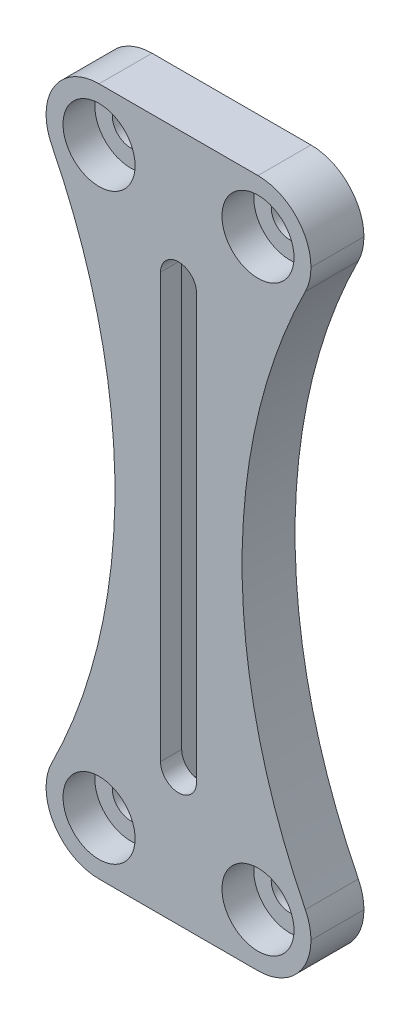
ISO-10303-21;
HEADER;
FILE_DESCRIPTION(('STEP AP214'),'2;1');
FILE_NAME('part.step','',(''),(''),'','','');
FILE_SCHEMA(('AUTOMOTIVE_DESIGN { 1 0 10303 214 1 1 1 1 }'));
ENDSEC;
DATA;
#1=APPLICATION_CONTEXT('core data for automotive mechanical design processes');
#2=APPLICATION_PROTOCOL_DEFINITION('international standard','automotive_design',2000,#1);
#3=PRODUCT_CONTEXT('',#1,'mechanical');
#4=PRODUCT('Part','Part','',(#3));
#5=PRODUCT_RELATED_PRODUCT_CATEGORY('part','',(#4));
#6=PRODUCT_DEFINITION_FORMATION('','',#4);
#7=PRODUCT_DEFINITION_CONTEXT('part definition',#1,'design');
#8=PRODUCT_DEFINITION('design','',#6,#7);
#9=PRODUCT_DEFINITION_SHAPE('','',#8);
#10=(LENGTH_UNIT() NAMED_UNIT(*) SI_UNIT(.MILLI.,.METRE.));
#11=(NAMED_UNIT(*) PLANE_ANGLE_UNIT() SI_UNIT($,.RADIAN.));
#12=(NAMED_UNIT(*) SI_UNIT($,.STERADIAN.) SOLID_ANGLE_UNIT());
#13=UNCERTAINTY_MEASURE_WITH_UNIT(LENGTH_MEASURE(1.E-05),#10,'distance_accuracy_value','');
#14=(GEOMETRIC_REPRESENTATION_CONTEXT(3) GLOBAL_UNCERTAINTY_ASSIGNED_CONTEXT((#13)) GLOBAL_UNIT_ASSIGNED_CONTEXT((#10,
#11,#12)) REPRESENTATION_CONTEXT('',''));
#15=CARTESIAN_POINT('',(0.,0.,0.));
#16=DIRECTION('',(0.,0.,1.));
#17=DIRECTION('',(1.,0.,0.));
#18=AXIS2_PLACEMENT_3D('',#15,#16,#17);
#19=CARTESIAN_POINT('',(7.5,-27.5,5.));
#20=DIRECTION('',(0.,0.,-1.));
#21=DIRECTION('',(-1.,0.,0.));
#22=AXIS2_PLACEMENT_3D('',#19,#20,#21);
#23=CYLINDRICAL_SURFACE('',#22,1.75);
#24=CARTESIAN_POINT('',(7.5,-27.5,0.));
#25=DIRECTION('',(0.,0.,1.));
#26=DIRECTION('',(-1.,0.,0.));
#27=AXIS2_PLACEMENT_3D('',#24,#25,#26);
#28=CIRCLE('',#27,1.75);
#29=CARTESIAN_POINT('',(5.75,-27.5,0.));
#30=VERTEX_POINT('',#29);
#31=EDGE_CURVE('E340',#30,#30,#28,.T.);
#32=ORIENTED_EDGE('',*,*,#31,.F.);
#33=EDGE_LOOP('',(#32));
#34=FACE_BOUND('',#33,.T.);
#35=CARTESIAN_POINT('',(7.5,-27.5,2.));
#36=DIRECTION('',(0.,0.,1.));
#37=DIRECTION('',(1.,0.,0.));
#38=AXIS2_PLACEMENT_3D('',#35,#36,#37);
#39=CIRCLE('',#38,1.75);
#40=CARTESIAN_POINT('',(9.25,-27.5,2.));
#41=VERTEX_POINT('',#40);
#42=EDGE_CURVE('E238',#41,#41,#39,.T.);
#43=ORIENTED_EDGE('',*,*,#42,.T.);
#44=EDGE_LOOP('',(#43));
#45=FACE_BOUND('',#44,.T.);
#46=ADVANCED_FACE('F33',(#34,#45),#23,.F.);
#47=CARTESIAN_POINT('',(-7.5,-27.5,5.));
#48=DIRECTION('',(0.,0.,-1.));
#49=DIRECTION('',(-1.,0.,0.));
#50=AXIS2_PLACEMENT_3D('',#47,#48,#49);
#51=CYLINDRICAL_SURFACE('',#50,1.75);
#52=CARTESIAN_POINT('',(-7.5,-27.5,0.));
#53=DIRECTION('',(0.,0.,1.));
#54=DIRECTION('',(1.,0.,0.));
#55=AXIS2_PLACEMENT_3D('',#52,#53,#54);
#56=CIRCLE('',#55,1.75);
#57=CARTESIAN_POINT('',(-5.75,-27.5,0.));
#58=VERTEX_POINT('',#57);
#59=EDGE_CURVE('E337',#58,#58,#56,.T.);
#60=ORIENTED_EDGE('',*,*,#59,.F.);
#61=EDGE_LOOP('',(#60));
#62=FACE_BOUND('',#61,.T.);
#63=CARTESIAN_POINT('',(-7.5,-27.5,2.));
#64=DIRECTION('',(0.,0.,1.));
#65=DIRECTION('',(1.,0.,0.));
#66=AXIS2_PLACEMENT_3D('',#63,#64,#65);
#67=CIRCLE('',#66,1.75);
#68=CARTESIAN_POINT('',(-5.75,-27.5,2.));
#69=VERTEX_POINT('',#68);
#70=EDGE_CURVE('E395',#69,#69,#67,.T.);
#71=ORIENTED_EDGE('',*,*,#70,.T.);
#72=EDGE_LOOP('',(#71));
#73=FACE_BOUND('',#72,.T.);
#74=ADVANCED_FACE('F455',(#62,#73),#51,.F.);
#75=CARTESIAN_POINT('',(-7.5,27.5,5.));
#76=DIRECTION('',(0.,0.,-1.));
#77=DIRECTION('',(-1.,0.,0.));
#78=AXIS2_PLACEMENT_3D('',#75,#76,#77);
#79=CYLINDRICAL_SURFACE('',#78,1.75);
#80=CARTESIAN_POINT('',(-7.5,27.5,0.));
#81=DIRECTION('',(0.,0.,1.));
#82=DIRECTION('',(-1.,0.,0.));
#83=AXIS2_PLACEMENT_3D('',#80,#81,#82);
#84=CIRCLE('',#83,1.75);
#85=CARTESIAN_POINT('',(-9.25,27.5,0.));
#86=VERTEX_POINT('',#85);
#87=EDGE_CURVE('E334',#86,#86,#84,.T.);
#88=ORIENTED_EDGE('',*,*,#87,.F.);
#89=EDGE_LOOP('',(#88));
#90=FACE_BOUND('',#89,.T.);
#91=CARTESIAN_POINT('',(-7.5,27.5,2.));
#92=DIRECTION('',(0.,0.,1.));
#93=DIRECTION('',(1.,0.,0.));
#94=AXIS2_PLACEMENT_3D('',#91,#92,#93);
#95=CIRCLE('',#94,1.75);
#96=CARTESIAN_POINT('',(-5.75,27.5,2.));
#97=VERTEX_POINT('',#96);
#98=EDGE_CURVE('E216',#97,#97,#95,.T.);
#99=ORIENTED_EDGE('',*,*,#98,.T.);
#100=EDGE_LOOP('',(#99));
#101=FACE_BOUND('',#100,.T.);
#102=ADVANCED_FACE('F461',(#90,#101),#79,.F.);
#103=CARTESIAN_POINT('',(7.5,27.5,5.));
#104=DIRECTION('',(0.,0.,-1.));
#105=DIRECTION('',(-1.,0.,0.));
#106=AXIS2_PLACEMENT_3D('',#103,#104,#105);
#107=CYLINDRICAL_SURFACE('',#106,1.75);
#108=CARTESIAN_POINT('',(7.5,27.5,0.));
#109=DIRECTION('',(0.,0.,1.));
#110=DIRECTION('',(1.,0.,0.));
#111=AXIS2_PLACEMENT_3D('',#108,#109,#110);
#112=CIRCLE('',#111,1.75);
#113=CARTESIAN_POINT('',(9.25,27.5,0.));
#114=VERTEX_POINT('',#113);
#115=EDGE_CURVE('E343',#114,#114,#112,.T.);
#116=ORIENTED_EDGE('',*,*,#115,.F.);
#117=EDGE_LOOP('',(#116));
#118=FACE_BOUND('',#117,.T.);
#119=CARTESIAN_POINT('',(7.5,27.5,2.));
#120=DIRECTION('',(0.,0.,1.));
#121=DIRECTION('',(1.,0.,0.));
#122=AXIS2_PLACEMENT_3D('',#119,#120,#121);
#123=CIRCLE('',#122,1.75);
#124=CARTESIAN_POINT('',(9.25,27.5,2.));
#125=VERTEX_POINT('',#124);
#126=EDGE_CURVE('E234',#125,#125,#123,.T.);
#127=ORIENTED_EDGE('',*,*,#126,.T.);
#128=EDGE_LOOP('',(#127));
#129=FACE_BOUND('',#128,.T.);
#130=ADVANCED_FACE('F418',(#118,#129),#107,.F.);
#131=CARTESIAN_POINT('',(0.,0.,5.));
#132=DIRECTION('',(0.,0.,-1.));
#133=DIRECTION('',(-1.,0.,0.));
#134=AXIS2_PLACEMENT_3D('',#131,#132,#133);
#135=PLANE('',#134);
#136=CARTESIAN_POINT('',(-7.5,27.5,5.));
#137=DIRECTION('',(0.,0.,1.));
#138=DIRECTION('',(1.,0.,0.));
#139=AXIS2_PLACEMENT_3D('',#136,#137,#138);
#140=CIRCLE('',#139,3.4);
#141=CARTESIAN_POINT('',(-4.1,27.5,5.));
#142=VERTEX_POINT('',#141);
#143=EDGE_CURVE('E217',#142,#142,#140,.T.);
#144=ORIENTED_EDGE('',*,*,#143,.F.);
#145=EDGE_LOOP('',(#144));
#146=FACE_BOUND('',#145,.T.);
#147=CARTESIAN_POINT('',(-7.5,-27.5,5.));
#148=DIRECTION('',(0.,0.,1.));
#149=DIRECTION('',(1.,0.,0.));
#150=AXIS2_PLACEMENT_3D('',#147,#148,#149);
#151=CIRCLE('',#150,3.4);
#152=CARTESIAN_POINT('',(-4.1,-27.5,5.));
#153=VERTEX_POINT('',#152);
#154=EDGE_CURVE('E223',#153,#153,#151,.T.);
#155=ORIENTED_EDGE('',*,*,#154,.F.);
#156=EDGE_LOOP('',(#155));
#157=FACE_BOUND('',#156,.T.);
#158=CARTESIAN_POINT('',(7.5,-27.5,5.));
#159=DIRECTION('',(0.,0.,1.));
#160=DIRECTION('',(1.,0.,0.));
#161=AXIS2_PLACEMENT_3D('',#158,#159,#160);
#162=CIRCLE('',#161,3.4);
#163=CARTESIAN_POINT('',(10.9,-27.5,5.));
#164=VERTEX_POINT('',#163);
#165=EDGE_CURVE('E212',#164,#164,#162,.T.);
#166=ORIENTED_EDGE('',*,*,#165,.F.);
#167=EDGE_LOOP('',(#166));
#168=FACE_BOUND('',#167,.T.);
#169=CARTESIAN_POINT('',(7.5,27.5,5.));
#170=DIRECTION('',(0.,0.,1.));
#171=DIRECTION('',(1.,0.,0.));
#172=AXIS2_PLACEMENT_3D('',#169,#170,#171);
#173=CIRCLE('',#172,3.4);
#174=CARTESIAN_POINT('',(10.9,27.5,5.));
#175=VERTEX_POINT('',#174);
#176=EDGE_CURVE('E235',#175,#175,#173,.T.);
#177=ORIENTED_EDGE('',*,*,#176,.F.);
#178=EDGE_LOOP('',(#177));
#179=FACE_BOUND('',#178,.T.);
#180=CARTESIAN_POINT('',(-7.5,-27.5,5.));
#181=DIRECTION('',(0.,0.,-1.));
#182=DIRECTION('',(-1.,0.,0.));
#183=AXIS2_PLACEMENT_3D('',#180,#181,#182);
#184=CIRCLE('',#183,5.);
#185=CARTESIAN_POINT('',(-11.9708829054477,-25.2614276768942,5.));
#186=VERTEX_POINT('',#185);
#187=CARTESIAN_POINT('',(-12.5,-27.5,5.));
#188=VERTEX_POINT('',#187);
#189=EDGE_CURVE('E252',#186,#188,#184,.F.);
#190=ORIENTED_EDGE('',*,*,#189,.T.);
#191=CARTESIAN_POINT('',(-7.5,-27.5,5.));
#192=DIRECTION('',(0.,0.,-1.));
#193=DIRECTION('',(-1.,0.,0.));
#194=AXIS2_PLACEMENT_3D('',#191,#192,#193);
#195=CIRCLE('',#194,5.);
#196=CARTESIAN_POINT('',(-7.5,-32.5,5.));
#197=VERTEX_POINT('',#196);
#198=EDGE_CURVE('E381',#188,#197,#195,.F.);
#199=ORIENTED_EDGE('',*,*,#198,.T.);
#200=DIRECTION('',(1.,0.,0.));
#201=VECTOR('',#200,1.);
#202=CARTESIAN_POINT('',(-12.5,-32.5,5.));
#203=LINE('',#202,#201);
#204=CARTESIAN_POINT('',(7.5,-32.5,5.));
#205=VERTEX_POINT('',#204);
#206=EDGE_CURVE('E350',#197,#205,#203,.T.);
#207=ORIENTED_EDGE('',*,*,#206,.T.);
#208=CARTESIAN_POINT('',(7.5,-27.5,5.));
#209=DIRECTION('',(0.,0.,-1.));
#210=DIRECTION('',(-1.,0.,0.));
#211=AXIS2_PLACEMENT_3D('',#208,#209,#210);
#212=CIRCLE('',#211,5.);
#213=CARTESIAN_POINT('',(12.5,-27.5,5.));
#214=VERTEX_POINT('',#213);
#215=EDGE_CURVE('E377',#205,#214,#212,.F.);
#216=ORIENTED_EDGE('',*,*,#215,.T.);
#217=CARTESIAN_POINT('',(7.5,-27.5,5.));
#218=DIRECTION('',(0.,0.,-1.));
#219=DIRECTION('',(-1.,0.,0.));
#220=AXIS2_PLACEMENT_3D('',#217,#218,#219);
#221=CIRCLE('',#220,5.);
#222=CARTESIAN_POINT('',(11.9708829054477,-25.2614276768942,5.));
#223=VERTEX_POINT('',#222);
#224=EDGE_CURVE('E303',#214,#223,#221,.F.);
#225=ORIENTED_EDGE('',*,*,#224,.T.);
#226=CARTESIAN_POINT('',(62.4230769230769,0.,5.));
#227=DIRECTION('',(0.,0.,-1.));
#228=DIRECTION('',(-1.,0.,0.));
#229=AXIS2_PLACEMENT_3D('',#226,#227,#228);
#230=CIRCLE('',#229,56.4230769230769);
#231=CARTESIAN_POINT('',(11.9708829054477,25.2614276768942,5.));
#232=VERTEX_POINT('',#231);
#233=EDGE_CURVE('E308',#223,#232,#230,.T.);
#234=ORIENTED_EDGE('',*,*,#233,.T.);
#235=CARTESIAN_POINT('',(7.5,27.5,5.));
#236=DIRECTION('',(0.,0.,-1.));
#237=DIRECTION('',(-1.,0.,0.));
#238=AXIS2_PLACEMENT_3D('',#235,#236,#237);
#239=CIRCLE('',#238,5.);
#240=CARTESIAN_POINT('',(12.5,27.5,5.));
#241=VERTEX_POINT('',#240);
#242=EDGE_CURVE('E289',#232,#241,#239,.F.);
#243=ORIENTED_EDGE('',*,*,#242,.T.);
#244=CARTESIAN_POINT('',(7.5,27.5,5.));
#245=DIRECTION('',(0.,0.,-1.));
#246=DIRECTION('',(-1.,0.,0.));
#247=AXIS2_PLACEMENT_3D('',#244,#245,#246);
#248=CIRCLE('',#247,5.);
#249=CARTESIAN_POINT('',(7.5,32.5,5.));
#250=VERTEX_POINT('',#249);
#251=EDGE_CURVE('E373',#241,#250,#248,.F.);
#252=ORIENTED_EDGE('',*,*,#251,.T.);
#253=DIRECTION('',(-1.,0.,0.));
#254=VECTOR('',#253,1.);
#255=CARTESIAN_POINT('',(-12.5,32.5,5.));
#256=LINE('',#255,#254);
#257=CARTESIAN_POINT('',(-7.5,32.5,5.));
#258=VERTEX_POINT('',#257);
#259=EDGE_CURVE('E347',#250,#258,#256,.T.);
#260=ORIENTED_EDGE('',*,*,#259,.T.);
#261=CARTESIAN_POINT('',(-7.5,27.5,5.));
#262=DIRECTION('',(0.,0.,-1.));
#263=DIRECTION('',(-1.,0.,0.));
#264=AXIS2_PLACEMENT_3D('',#261,#262,#263);
#265=CIRCLE('',#264,5.);
#266=CARTESIAN_POINT('',(-12.5,27.5,5.));
#267=VERTEX_POINT('',#266);
#268=EDGE_CURVE('E371',#258,#267,#265,.F.);
#269=ORIENTED_EDGE('',*,*,#268,.T.);
#270=CARTESIAN_POINT('',(-7.5,27.5,5.));
#271=DIRECTION('',(0.,0.,-1.));
#272=DIRECTION('',(-1.,0.,0.));
#273=AXIS2_PLACEMENT_3D('',#270,#271,#272);
#274=CIRCLE('',#273,5.);
#275=CARTESIAN_POINT('',(-11.9708829054477,25.2614276768942,5.));
#276=VERTEX_POINT('',#275);
#277=EDGE_CURVE('E266',#267,#276,#274,.F.);
#278=ORIENTED_EDGE('',*,*,#277,.T.);
#279=CARTESIAN_POINT('',(-62.4230769230769,0.,5.));
#280=DIRECTION('',(0.,0.,-1.));
#281=DIRECTION('',(-1.,0.,0.));
#282=AXIS2_PLACEMENT_3D('',#279,#280,#281);
#283=CIRCLE('',#282,56.4230769230769);
#284=EDGE_CURVE('E271',#276,#186,#283,.T.);
#285=ORIENTED_EDGE('',*,*,#284,.T.);
#286=EDGE_LOOP('',(#190,#199,#207,#216,#225,#234,#243,#252,#260,#269,#278,#285));
#287=FACE_BOUND('',#286,.T.);
#288=CARTESIAN_POINT('',(0.,-20.,5.));
#289=DIRECTION('',(0.,0.,1.));
#290=DIRECTION('',(1.,0.,0.));
#291=AXIS2_PLACEMENT_3D('',#288,#289,#290);
#292=CIRCLE('',#291,1.70000000000001);
#293=CARTESIAN_POINT('',(-1.70000000000001,-20.,5.));
#294=VERTEX_POINT('',#293);
#295=CARTESIAN_POINT('',(1.70000000000001,-20.,5.));
#296=VERTEX_POINT('',#295);
#297=EDGE_CURVE('E313',#294,#296,#292,.T.);
#298=ORIENTED_EDGE('',*,*,#297,.F.);
#299=DIRECTION('',(0.,-1.,0.));
#300=VECTOR('',#299,1.);
#301=CARTESIAN_POINT('',(-1.70000000000001,-20.,5.));
#302=LINE('',#301,#300);
#303=CARTESIAN_POINT('',(-1.70000000000002,20.,5.));
#304=VERTEX_POINT('',#303);
#305=EDGE_CURVE('E320',#304,#294,#302,.T.);
#306=ORIENTED_EDGE('',*,*,#305,.F.);
#307=CARTESIAN_POINT('',(0.,20.,5.));
#308=DIRECTION('',(0.,0.,1.));
#309=DIRECTION('',(1.,0.,0.));
#310=AXIS2_PLACEMENT_3D('',#307,#308,#309);
#311=CIRCLE('',#310,1.70000000000001);
#312=CARTESIAN_POINT('',(1.7,20.,5.));
#313=VERTEX_POINT('',#312);
#314=EDGE_CURVE('E317',#313,#304,#311,.T.);
#315=ORIENTED_EDGE('',*,*,#314,.F.);
#316=DIRECTION('',(0.,1.,0.));
#317=VECTOR('',#316,1.);
#318=CARTESIAN_POINT('',(1.70000000000001,-20.,5.));
#319=LINE('',#318,#317);
#320=EDGE_CURVE('E315',#296,#313,#319,.T.);
#321=ORIENTED_EDGE('',*,*,#320,.F.);
#322=EDGE_LOOP('',(#298,#306,#315,#321));
#323=FACE_BOUND('',#322,.T.);
#324=ADVANCED_FACE('F414',(#146,#157,#168,#179,#287,#323),#135,.F.);
#325=CARTESIAN_POINT('',(0.,0.,0.));
#326=DIRECTION('',(0.,0.,-1.));
#327=DIRECTION('',(-1.,0.,0.));
#328=AXIS2_PLACEMENT_3D('',#325,#326,#327);
#329=PLANE('',#328);
#330=DIRECTION('',(0.,1.,0.));
#331=VECTOR('',#330,1.);
#332=CARTESIAN_POINT('',(-2.8,-24.,0.));
#333=LINE('',#332,#331);
#334=CARTESIAN_POINT('',(-2.8,-24.,0.));
#335=VERTEX_POINT('',#334);
#336=CARTESIAN_POINT('',(-2.8,24.,0.));
#337=VERTEX_POINT('',#336);
#338=EDGE_CURVE('E48',#335,#337,#333,.T.);
#339=ORIENTED_EDGE('',*,*,#338,.F.);
#340=DIRECTION('',(-1.,0.,0.));
#341=VECTOR('',#340,1.);
#342=CARTESIAN_POINT('',(2.8,-24.,0.));
#343=LINE('',#342,#341);
#344=CARTESIAN_POINT('',(2.8,-24.,0.));
#345=VERTEX_POINT('',#344);
#346=EDGE_CURVE('E189',#345,#335,#343,.T.);
#347=ORIENTED_EDGE('',*,*,#346,.F.);
#348=DIRECTION('',(0.,-1.,0.));
#349=VECTOR('',#348,1.);
#350=CARTESIAN_POINT('',(2.8,-24.,0.));
#351=LINE('',#350,#349);
#352=CARTESIAN_POINT('',(2.8,24.,0.));
#353=VERTEX_POINT('',#352);
#354=EDGE_CURVE('E192',#353,#345,#351,.T.);
#355=ORIENTED_EDGE('',*,*,#354,.F.);
#356=DIRECTION('',(1.,0.,0.));
#357=VECTOR('',#356,1.);
#358=CARTESIAN_POINT('',(2.8,24.,0.));
#359=LINE('',#358,#357);
#360=EDGE_CURVE('E198',#337,#353,#359,.T.);
#361=ORIENTED_EDGE('',*,*,#360,.F.);
#362=EDGE_LOOP('',(#339,#347,#355,#361));
#363=FACE_BOUND('',#362,.T.);
#364=DIRECTION('',(1.,0.,0.));
#365=VECTOR('',#364,1.);
#366=CARTESIAN_POINT('',(-12.5,-32.5,0.));
#367=LINE('',#366,#365);
#368=CARTESIAN_POINT('',(-7.5,-32.5,0.));
#369=VERTEX_POINT('',#368);
#370=CARTESIAN_POINT('',(7.5,-32.5,0.));
#371=VERTEX_POINT('',#370);
#372=EDGE_CURVE('E351',#369,#371,#367,.T.);
#373=ORIENTED_EDGE('',*,*,#372,.F.);
#374=CARTESIAN_POINT('',(-7.5,-27.5,0.));
#375=DIRECTION('',(0.,0.,-1.));
#376=DIRECTION('',(-1.,0.,0.));
#377=AXIS2_PLACEMENT_3D('',#374,#375,#376);
#378=CIRCLE('',#377,5.);
#379=CARTESIAN_POINT('',(-12.5,-27.5,0.));
#380=VERTEX_POINT('',#379);
#381=EDGE_CURVE('E369',#369,#380,#378,.T.);
#382=ORIENTED_EDGE('',*,*,#381,.T.);
#383=CARTESIAN_POINT('',(-7.5,-27.5,0.));
#384=DIRECTION('',(0.,0.,-1.));
#385=DIRECTION('',(-1.,0.,0.));
#386=AXIS2_PLACEMENT_3D('',#383,#384,#385);
#387=CIRCLE('',#386,5.);
#388=CARTESIAN_POINT('',(-11.9708829054477,-25.2614276768942,0.));
#389=VERTEX_POINT('',#388);
#390=EDGE_CURVE('E242',#380,#389,#387,.T.);
#391=ORIENTED_EDGE('',*,*,#390,.T.);
#392=CARTESIAN_POINT('',(-62.4230769230769,0.,0.));
#393=DIRECTION('',(0.,0.,1.));
#394=DIRECTION('',(-1.,0.,0.));
#395=AXIS2_PLACEMENT_3D('',#392,#393,#394);
#396=CIRCLE('',#395,56.4230769230769);
#397=CARTESIAN_POINT('',(-11.9708829054477,25.2614276768942,0.));
#398=VERTEX_POINT('',#397);
#399=EDGE_CURVE('E245',#389,#398,#396,.T.);
#400=ORIENTED_EDGE('',*,*,#399,.T.);
#401=CARTESIAN_POINT('',(-7.5,27.5,0.));
#402=DIRECTION('',(0.,0.,-1.));
#403=DIRECTION('',(1.,0.,0.));
#404=AXIS2_PLACEMENT_3D('',#401,#402,#403);
#405=CIRCLE('',#404,5.);
#406=CARTESIAN_POINT('',(-12.5,27.5,0.));
#407=VERTEX_POINT('',#406);
#408=EDGE_CURVE('E239',#398,#407,#405,.T.);
#409=ORIENTED_EDGE('',*,*,#408,.T.);
#410=CARTESIAN_POINT('',(-7.5,27.5,0.));
#411=DIRECTION('',(0.,0.,-1.));
#412=DIRECTION('',(-1.,0.,0.));
#413=AXIS2_PLACEMENT_3D('',#410,#411,#412);
#414=CIRCLE('',#413,5.);
#415=CARTESIAN_POINT('',(-7.5,32.5,0.));
#416=VERTEX_POINT('',#415);
#417=EDGE_CURVE('E363',#407,#416,#414,.T.);
#418=ORIENTED_EDGE('',*,*,#417,.T.);
#419=DIRECTION('',(-1.,0.,0.));
#420=VECTOR('',#419,1.);
#421=CARTESIAN_POINT('',(-12.5,32.5,0.));
#422=LINE('',#421,#420);
#423=CARTESIAN_POINT('',(7.5,32.5,0.));
#424=VERTEX_POINT('',#423);
#425=EDGE_CURVE('E346',#424,#416,#422,.T.);
#426=ORIENTED_EDGE('',*,*,#425,.F.);
#427=CARTESIAN_POINT('',(7.5,27.5,0.));
#428=DIRECTION('',(0.,0.,-1.));
#429=DIRECTION('',(-1.,0.,0.));
#430=AXIS2_PLACEMENT_3D('',#427,#428,#429);
#431=CIRCLE('',#430,5.);
#432=CARTESIAN_POINT('',(12.5,27.5,0.));
#433=VERTEX_POINT('',#432);
#434=EDGE_CURVE('E365',#424,#433,#431,.T.);
#435=ORIENTED_EDGE('',*,*,#434,.T.);
#436=CARTESIAN_POINT('',(7.5,27.5,0.));
#437=DIRECTION('',(0.,0.,-1.));
#438=DIRECTION('',(-1.,0.,0.));
#439=AXIS2_PLACEMENT_3D('',#436,#437,#438);
#440=CIRCLE('',#439,5.);
#441=CARTESIAN_POINT('',(11.9708829054477,25.2614276768942,0.));
#442=VERTEX_POINT('',#441);
#443=EDGE_CURVE('E279',#433,#442,#440,.T.);
#444=ORIENTED_EDGE('',*,*,#443,.T.);
#445=CARTESIAN_POINT('',(62.4230769230769,0.,0.));
#446=DIRECTION('',(0.,0.,1.));
#447=DIRECTION('',(1.,0.,0.));
#448=AXIS2_PLACEMENT_3D('',#445,#446,#447);
#449=CIRCLE('',#448,56.4230769230769);
#450=CARTESIAN_POINT('',(11.9708829054477,-25.2614276768942,0.));
#451=VERTEX_POINT('',#450);
#452=EDGE_CURVE('E282',#442,#451,#449,.T.);
#453=ORIENTED_EDGE('',*,*,#452,.T.);
#454=CARTESIAN_POINT('',(7.5,-27.5,0.));
#455=DIRECTION('',(0.,0.,-1.));
#456=DIRECTION('',(1.,0.,0.));
#457=AXIS2_PLACEMENT_3D('',#454,#455,#456);
#458=CIRCLE('',#457,5.);
#459=CARTESIAN_POINT('',(12.5,-27.5,0.));
#460=VERTEX_POINT('',#459);
#461=EDGE_CURVE('E276',#451,#460,#458,.T.);
#462=ORIENTED_EDGE('',*,*,#461,.T.);
#463=CARTESIAN_POINT('',(7.5,-27.5,0.));
#464=DIRECTION('',(0.,0.,-1.));
#465=DIRECTION('',(-1.,0.,0.));
#466=AXIS2_PLACEMENT_3D('',#463,#464,#465);
#467=CIRCLE('',#466,5.);
#468=EDGE_CURVE('E367',#460,#371,#467,.T.);
#469=ORIENTED_EDGE('',*,*,#468,.T.);
#470=EDGE_LOOP('',(#373,#382,#391,#400,#409,#418,#426,#435,#444,#453,#462,#469));
#471=FACE_BOUND('',#470,.T.);
#472=ORIENTED_EDGE('',*,*,#59,.T.);
#473=EDGE_LOOP('',(#472));
#474=FACE_BOUND('',#473,.T.);
#475=ORIENTED_EDGE('',*,*,#115,.T.);
#476=EDGE_LOOP('',(#475));
#477=FACE_BOUND('',#476,.T.);
#478=ORIENTED_EDGE('',*,*,#31,.T.);
#479=EDGE_LOOP('',(#478));
#480=FACE_BOUND('',#479,.T.);
#481=ORIENTED_EDGE('',*,*,#87,.T.);
#482=EDGE_LOOP('',(#481));
#483=FACE_BOUND('',#482,.T.);
#484=ADVANCED_FACE('F417',(#363,#471,#474,#477,#480,#483),#329,.T.);
#485=CARTESIAN_POINT('',(-12.5,32.5,5.));
#486=DIRECTION('',(0.,-1.,0.));
#487=DIRECTION('',(0.,0.,-1.));
#488=AXIS2_PLACEMENT_3D('',#485,#486,#487);
#489=PLANE('',#488);
#490=ORIENTED_EDGE('',*,*,#259,.F.);
#491=DIRECTION('',(0.,0.,-1.));
#492=VECTOR('',#491,1.);
#493=CARTESIAN_POINT('',(7.5,32.5,5.));
#494=LINE('',#493,#492);
#495=EDGE_CURVE('E41',#250,#424,#494,.T.);
#496=ORIENTED_EDGE('',*,*,#495,.T.);
#497=ORIENTED_EDGE('',*,*,#425,.T.);
#498=DIRECTION('',(0.,0.,-1.));
#499=VECTOR('',#498,1.);
#500=CARTESIAN_POINT('',(-7.5,32.5,5.));
#501=LINE('',#500,#499);
#502=EDGE_CURVE('E385',#416,#258,#501,.F.);
#503=ORIENTED_EDGE('',*,*,#502,.T.);
#504=EDGE_LOOP('',(#490,#496,#497,#503));
#505=FACE_BOUND('',#504,.T.);
#506=ADVANCED_FACE('F472',(#505),#489,.F.);
#507=CARTESIAN_POINT('',(-12.5,-32.5,5.));
#508=DIRECTION('',(0.,1.,0.));
#509=DIRECTION('',(0.,0.,1.));
#510=AXIS2_PLACEMENT_3D('',#507,#508,#509);
#511=PLANE('',#510);
#512=ORIENTED_EDGE('',*,*,#206,.F.);
#513=DIRECTION('',(0.,0.,-1.));
#514=VECTOR('',#513,1.);
#515=CARTESIAN_POINT('',(-7.5,-32.5,5.));
#516=LINE('',#515,#514);
#517=EDGE_CURVE('E360',#197,#369,#516,.T.);
#518=ORIENTED_EDGE('',*,*,#517,.T.);
#519=ORIENTED_EDGE('',*,*,#372,.T.);
#520=DIRECTION('',(0.,0.,-1.));
#521=VECTOR('',#520,1.);
#522=CARTESIAN_POINT('',(7.5,-32.5,5.));
#523=LINE('',#522,#521);
#524=EDGE_CURVE('E354',#371,#205,#523,.F.);
#525=ORIENTED_EDGE('',*,*,#524,.T.);
#526=EDGE_LOOP('',(#512,#518,#519,#525));
#527=FACE_BOUND('',#526,.T.);
#528=ADVANCED_FACE('F474',(#527),#511,.F.);
#529=CARTESIAN_POINT('',(0.,-20.,5.));
#530=DIRECTION('',(0.,0.,-1.));
#531=DIRECTION('',(-1.,0.,0.));
#532=AXIS2_PLACEMENT_3D('',#529,#530,#531);
#533=CYLINDRICAL_SURFACE('',#532,1.70000000000001);
#534=CARTESIAN_POINT('',(0.,-20.,3.));
#535=DIRECTION('',(0.,0.,1.));
#536=DIRECTION('',(1.,0.,0.));
#537=AXIS2_PLACEMENT_3D('',#534,#535,#536);
#538=CIRCLE('',#537,1.70000000000001);
#539=CARTESIAN_POINT('',(-1.70000000000001,-20.,3.));
#540=VERTEX_POINT('',#539);
#541=CARTESIAN_POINT('',(1.70000000000001,-20.,3.));
#542=VERTEX_POINT('',#541);
#543=EDGE_CURVE('E210',#540,#542,#538,.T.);
#544=ORIENTED_EDGE('',*,*,#543,.F.);
#545=DIRECTION('',(0.,0.,-1.));
#546=VECTOR('',#545,1.);
#547=CARTESIAN_POINT('',(-1.70000000000001,-20.,5.));
#548=LINE('',#547,#546);
#549=EDGE_CURVE('E322',#294,#540,#548,.T.);
#550=ORIENTED_EDGE('',*,*,#549,.F.);
#551=ORIENTED_EDGE('',*,*,#297,.T.);
#552=DIRECTION('',(0.,0.,-1.));
#553=VECTOR('',#552,1.);
#554=CARTESIAN_POINT('',(1.70000000000001,-20.,5.));
#555=LINE('',#554,#553);
#556=EDGE_CURVE('E331',#296,#542,#555,.T.);
#557=ORIENTED_EDGE('',*,*,#556,.T.);
#558=EDGE_LOOP('',(#544,#550,#551,#557));
#559=FACE_BOUND('',#558,.T.);
#560=ADVANCED_FACE('F433',(#559),#533,.F.);
#561=CARTESIAN_POINT('',(1.70000000000001,-20.,5.));
#562=DIRECTION('',(-1.,0.,0.));
#563=DIRECTION('',(0.,-1.,0.));
#564=AXIS2_PLACEMENT_3D('',#561,#562,#563);
#565=PLANE('',#564);
#566=DIRECTION('',(0.,1.,0.));
#567=VECTOR('',#566,1.);
#568=CARTESIAN_POINT('',(1.70000000000001,-20.,3.));
#569=LINE('',#568,#567);
#570=CARTESIAN_POINT('',(1.7,20.,3.));
#571=VERTEX_POINT('',#570);
#572=EDGE_CURVE('E208',#542,#571,#569,.T.);
#573=ORIENTED_EDGE('',*,*,#572,.F.);
#574=ORIENTED_EDGE('',*,*,#556,.F.);
#575=ORIENTED_EDGE('',*,*,#320,.T.);
#576=DIRECTION('',(0.,0.,-1.));
#577=VECTOR('',#576,1.);
#578=CARTESIAN_POINT('',(1.7,20.,5.));
#579=LINE('',#578,#577);
#580=EDGE_CURVE('E328',#313,#571,#579,.T.);
#581=ORIENTED_EDGE('',*,*,#580,.T.);
#582=EDGE_LOOP('',(#573,#574,#575,#581));
#583=FACE_BOUND('',#582,.T.);
#584=ADVANCED_FACE('F436',(#583),#565,.T.);
#585=CARTESIAN_POINT('',(0.,20.,5.));
#586=DIRECTION('',(0.,0.,-1.));
#587=DIRECTION('',(-1.,0.,0.));
#588=AXIS2_PLACEMENT_3D('',#585,#586,#587);
#589=CYLINDRICAL_SURFACE('',#588,1.70000000000001);
#590=CARTESIAN_POINT('',(0.,20.,3.));
#591=DIRECTION('',(0.,0.,1.));
#592=DIRECTION('',(1.,0.,0.));
#593=AXIS2_PLACEMENT_3D('',#590,#591,#592);
#594=CIRCLE('',#593,1.70000000000001);
#595=CARTESIAN_POINT('',(-1.70000000000002,20.,3.));
#596=VERTEX_POINT('',#595);
#597=EDGE_CURVE('E55',#571,#596,#594,.T.);
#598=ORIENTED_EDGE('',*,*,#597,.F.);
#599=ORIENTED_EDGE('',*,*,#580,.F.);
#600=ORIENTED_EDGE('',*,*,#314,.T.);
#601=DIRECTION('',(0.,0.,-1.));
#602=VECTOR('',#601,1.);
#603=CARTESIAN_POINT('',(-1.70000000000002,20.,5.));
#604=LINE('',#603,#602);
#605=EDGE_CURVE('E325',#304,#596,#604,.T.);
#606=ORIENTED_EDGE('',*,*,#605,.T.);
#607=EDGE_LOOP('',(#598,#599,#600,#606));
#608=FACE_BOUND('',#607,.T.);
#609=ADVANCED_FACE('F439',(#608),#589,.F.);
#610=CARTESIAN_POINT('',(-1.70000000000001,-20.,5.));
#611=DIRECTION('',(1.,0.,0.));
#612=DIRECTION('',(0.,1.,0.));
#613=AXIS2_PLACEMENT_3D('',#610,#611,#612);
#614=PLANE('',#613);
#615=DIRECTION('',(0.,-1.,0.));
#616=VECTOR('',#615,1.);
#617=CARTESIAN_POINT('',(-1.70000000000001,-20.,3.));
#618=LINE('',#617,#616);
#619=EDGE_CURVE('E11',#596,#540,#618,.T.);
#620=ORIENTED_EDGE('',*,*,#619,.F.);
#621=ORIENTED_EDGE('',*,*,#605,.F.);
#622=ORIENTED_EDGE('',*,*,#305,.T.);
#623=ORIENTED_EDGE('',*,*,#549,.T.);
#624=EDGE_LOOP('',(#620,#621,#622,#623));
#625=FACE_BOUND('',#624,.T.);
#626=ADVANCED_FACE('F441',(#625),#614,.T.);
#627=CARTESIAN_POINT('',(62.4230769230769,0.,0.));
#628=DIRECTION('',(0.,0.,1.));
#629=DIRECTION('',(1.,0.,0.));
#630=AXIS2_PLACEMENT_3D('',#627,#628,#629);
#631=CYLINDRICAL_SURFACE('',#630,56.4230769230769);
#632=DIRECTION('',(0.,0.,1.));
#633=VECTOR('',#632,1.);
#634=CARTESIAN_POINT('',(11.9708829054477,-25.2614276768942,0.));
#635=LINE('',#634,#633);
#636=EDGE_CURVE('E286',#451,#223,#635,.T.);
#637=ORIENTED_EDGE('',*,*,#636,.F.);
#638=ORIENTED_EDGE('',*,*,#452,.F.);
#639=DIRECTION('',(0.,0.,1.));
#640=VECTOR('',#639,1.);
#641=CARTESIAN_POINT('',(11.9708829054477,25.2614276768942,0.));
#642=LINE('',#641,#640);
#643=EDGE_CURVE('E290',#442,#232,#642,.T.);
#644=ORIENTED_EDGE('',*,*,#643,.T.);
#645=ORIENTED_EDGE('',*,*,#233,.F.);
#646=EDGE_LOOP('',(#637,#638,#644,#645));
#647=FACE_BOUND('',#646,.T.);
#648=ADVANCED_FACE('F443',(#647),#631,.F.);
#649=CARTESIAN_POINT('',(7.5,-27.5,0.));
#650=DIRECTION('',(0.,0.,1.));
#651=DIRECTION('',(1.,0.,0.));
#652=AXIS2_PLACEMENT_3D('',#649,#650,#651);
#653=CYLINDRICAL_SURFACE('',#652,5.);
#654=DIRECTION('',(0.,0.,1.));
#655=VECTOR('',#654,1.);
#656=CARTESIAN_POINT('',(12.5,-27.5,0.));
#657=LINE('',#656,#655);
#658=EDGE_CURVE('E285',#460,#214,#657,.T.);
#659=ORIENTED_EDGE('',*,*,#658,.F.);
#660=ORIENTED_EDGE('',*,*,#461,.F.);
#661=ORIENTED_EDGE('',*,*,#636,.T.);
#662=ORIENTED_EDGE('',*,*,#224,.F.);
#663=EDGE_LOOP('',(#659,#660,#661,#662));
#664=FACE_BOUND('',#663,.T.);
#665=ADVANCED_FACE('F449',(#664),#653,.T.);
#666=CARTESIAN_POINT('',(7.5,27.5,0.));
#667=DIRECTION('',(0.,0.,1.));
#668=DIRECTION('',(1.,0.,0.));
#669=AXIS2_PLACEMENT_3D('',#666,#667,#668);
#670=CYLINDRICAL_SURFACE('',#669,5.);
#671=ORIENTED_EDGE('',*,*,#643,.F.);
#672=ORIENTED_EDGE('',*,*,#443,.F.);
#673=DIRECTION('',(0.,0.,1.));
#674=VECTOR('',#673,1.);
#675=CARTESIAN_POINT('',(12.5,27.5,0.));
#676=LINE('',#675,#674);
#677=EDGE_CURVE('E293',#433,#241,#676,.T.);
#678=ORIENTED_EDGE('',*,*,#677,.T.);
#679=ORIENTED_EDGE('',*,*,#242,.F.);
#680=EDGE_LOOP('',(#671,#672,#678,#679));
#681=FACE_BOUND('',#680,.T.);
#682=ADVANCED_FACE('F527',(#681),#670,.T.);
#683=CARTESIAN_POINT('',(-62.4230769230769,0.,0.));
#684=DIRECTION('',(0.,0.,1.));
#685=DIRECTION('',(1.,0.,0.));
#686=AXIS2_PLACEMENT_3D('',#683,#684,#685);
#687=CYLINDRICAL_SURFACE('',#686,56.4230769230769);
#688=DIRECTION('',(0.,0.,1.));
#689=VECTOR('',#688,1.);
#690=CARTESIAN_POINT('',(-11.9708829054477,25.2614276768942,0.));
#691=LINE('',#690,#689);
#692=EDGE_CURVE('E249',#398,#276,#691,.T.);
#693=ORIENTED_EDGE('',*,*,#692,.F.);
#694=ORIENTED_EDGE('',*,*,#399,.F.);
#695=DIRECTION('',(0.,0.,1.));
#696=VECTOR('',#695,1.);
#697=CARTESIAN_POINT('',(-11.9708829054477,-25.2614276768942,0.));
#698=LINE('',#697,#696);
#699=EDGE_CURVE('E253',#389,#186,#698,.T.);
#700=ORIENTED_EDGE('',*,*,#699,.T.);
#701=ORIENTED_EDGE('',*,*,#284,.F.);
#702=EDGE_LOOP('',(#693,#694,#700,#701));
#703=FACE_BOUND('',#702,.T.);
#704=ADVANCED_FACE('F511',(#703),#687,.F.);
#705=CARTESIAN_POINT('',(-7.5,27.5,0.));
#706=DIRECTION('',(0.,0.,1.));
#707=DIRECTION('',(1.,0.,0.));
#708=AXIS2_PLACEMENT_3D('',#705,#706,#707);
#709=CYLINDRICAL_SURFACE('',#708,5.);
#710=DIRECTION('',(0.,0.,1.));
#711=VECTOR('',#710,1.);
#712=CARTESIAN_POINT('',(-12.5,27.5,0.));
#713=LINE('',#712,#711);
#714=EDGE_CURVE('E248',#407,#267,#713,.T.);
#715=ORIENTED_EDGE('',*,*,#714,.F.);
#716=ORIENTED_EDGE('',*,*,#408,.F.);
#717=ORIENTED_EDGE('',*,*,#692,.T.);
#718=ORIENTED_EDGE('',*,*,#277,.F.);
#719=EDGE_LOOP('',(#715,#716,#717,#718));
#720=FACE_BOUND('',#719,.T.);
#721=ADVANCED_FACE('F507',(#720),#709,.T.);
#722=CARTESIAN_POINT('',(-7.5,-27.5,0.));
#723=DIRECTION('',(0.,0.,1.));
#724=DIRECTION('',(1.,0.,0.));
#725=AXIS2_PLACEMENT_3D('',#722,#723,#724);
#726=CYLINDRICAL_SURFACE('',#725,5.);
#727=ORIENTED_EDGE('',*,*,#699,.F.);
#728=ORIENTED_EDGE('',*,*,#390,.F.);
#729=DIRECTION('',(0.,0.,1.));
#730=VECTOR('',#729,1.);
#731=CARTESIAN_POINT('',(-12.5,-27.5,0.));
#732=LINE('',#731,#730);
#733=EDGE_CURVE('E256',#380,#188,#732,.T.);
#734=ORIENTED_EDGE('',*,*,#733,.T.);
#735=ORIENTED_EDGE('',*,*,#189,.F.);
#736=EDGE_LOOP('',(#727,#728,#734,#735));
#737=FACE_BOUND('',#736,.T.);
#738=ADVANCED_FACE('F485',(#737),#726,.T.);
#739=CARTESIAN_POINT('',(-7.5,-27.5,5.));
#740=DIRECTION('',(0.,0.,-1.));
#741=DIRECTION('',(-1.,0.,0.));
#742=AXIS2_PLACEMENT_3D('',#739,#740,#741);
#743=CYLINDRICAL_SURFACE('',#742,5.);
#744=ORIENTED_EDGE('',*,*,#198,.F.);
#745=ORIENTED_EDGE('',*,*,#733,.F.);
#746=ORIENTED_EDGE('',*,*,#381,.F.);
#747=ORIENTED_EDGE('',*,*,#517,.F.);
#748=EDGE_LOOP('',(#744,#745,#746,#747));
#749=FACE_BOUND('',#748,.T.);
#750=ADVANCED_FACE('F481',(#749),#743,.T.);
#751=CARTESIAN_POINT('',(7.5,-27.5,5.));
#752=DIRECTION('',(0.,0.,-1.));
#753=DIRECTION('',(-1.,0.,0.));
#754=AXIS2_PLACEMENT_3D('',#751,#752,#753);
#755=CYLINDRICAL_SURFACE('',#754,5.);
#756=ORIENTED_EDGE('',*,*,#215,.F.);
#757=ORIENTED_EDGE('',*,*,#524,.F.);
#758=ORIENTED_EDGE('',*,*,#468,.F.);
#759=ORIENTED_EDGE('',*,*,#658,.T.);
#760=EDGE_LOOP('',(#756,#757,#758,#759));
#761=FACE_BOUND('',#760,.T.);
#762=ADVANCED_FACE('F484',(#761),#755,.T.);
#763=CARTESIAN_POINT('',(7.5,27.5,5.));
#764=DIRECTION('',(0.,0.,-1.));
#765=DIRECTION('',(-1.,0.,0.));
#766=AXIS2_PLACEMENT_3D('',#763,#764,#765);
#767=CYLINDRICAL_SURFACE('',#766,5.);
#768=ORIENTED_EDGE('',*,*,#251,.F.);
#769=ORIENTED_EDGE('',*,*,#677,.F.);
#770=ORIENTED_EDGE('',*,*,#434,.F.);
#771=ORIENTED_EDGE('',*,*,#495,.F.);
#772=EDGE_LOOP('',(#768,#769,#770,#771));
#773=FACE_BOUND('',#772,.T.);
#774=ADVANCED_FACE('F488',(#773),#767,.T.);
#775=CARTESIAN_POINT('',(-7.5,27.5,5.));
#776=DIRECTION('',(0.,0.,-1.));
#777=DIRECTION('',(-1.,0.,0.));
#778=AXIS2_PLACEMENT_3D('',#775,#776,#777);
#779=CYLINDRICAL_SURFACE('',#778,5.);
#780=ORIENTED_EDGE('',*,*,#268,.F.);
#781=ORIENTED_EDGE('',*,*,#502,.F.);
#782=ORIENTED_EDGE('',*,*,#417,.F.);
#783=ORIENTED_EDGE('',*,*,#714,.T.);
#784=EDGE_LOOP('',(#780,#781,#782,#783));
#785=FACE_BOUND('',#784,.T.);
#786=ADVANCED_FACE('F35',(#785),#779,.T.);
#787=CARTESIAN_POINT('',(7.5,27.5,2.));
#788=DIRECTION('',(0.,0.,1.));
#789=DIRECTION('',(1.,0.,0.));
#790=AXIS2_PLACEMENT_3D('',#787,#788,#789);
#791=CYLINDRICAL_SURFACE('',#790,3.4);
#792=CARTESIAN_POINT('',(7.5,27.5,2.));
#793=DIRECTION('',(0.,0.,1.));
#794=DIRECTION('',(1.,0.,0.));
#795=AXIS2_PLACEMENT_3D('',#792,#793,#794);
#796=CIRCLE('',#795,3.4);
#797=CARTESIAN_POINT('',(10.9,27.5,2.));
#798=VERTEX_POINT('',#797);
#799=EDGE_CURVE('E231',#798,#798,#796,.T.);
#800=ORIENTED_EDGE('',*,*,#799,.F.);
#801=EDGE_LOOP('',(#800));
#802=FACE_BOUND('',#801,.T.);
#803=ORIENTED_EDGE('',*,*,#176,.T.);
#804=EDGE_LOOP('',(#803));
#805=FACE_BOUND('',#804,.T.);
#806=ADVANCED_FACE('F495',(#802,#805),#791,.F.);
#807=CARTESIAN_POINT('',(7.5,27.5,2.));
#808=DIRECTION('',(0.,0.,1.));
#809=DIRECTION('',(1.,0.,0.));
#810=AXIS2_PLACEMENT_3D('',#807,#808,#809);
#811=PLANE('',#810);
#812=ORIENTED_EDGE('',*,*,#126,.F.);
#813=EDGE_LOOP('',(#812));
#814=FACE_BOUND('',#813,.T.);
#815=ORIENTED_EDGE('',*,*,#799,.T.);
#816=EDGE_LOOP('',(#815));
#817=FACE_BOUND('',#816,.T.);
#818=ADVANCED_FACE('F551',(#814,#817),#811,.T.);
#819=CARTESIAN_POINT('',(-7.5,27.5,2.));
#820=DIRECTION('',(0.,0.,1.));
#821=DIRECTION('',(1.,0.,0.));
#822=AXIS2_PLACEMENT_3D('',#819,#820,#821);
#823=CYLINDRICAL_SURFACE('',#822,3.4);
#824=CARTESIAN_POINT('',(-7.5,27.5,2.));
#825=DIRECTION('',(0.,0.,1.));
#826=DIRECTION('',(1.,0.,0.));
#827=AXIS2_PLACEMENT_3D('',#824,#825,#826);
#828=CIRCLE('',#827,3.4);
#829=CARTESIAN_POINT('',(-4.1,27.5,2.));
#830=VERTEX_POINT('',#829);
#831=EDGE_CURVE('E213',#830,#830,#828,.T.);
#832=ORIENTED_EDGE('',*,*,#831,.F.);
#833=EDGE_LOOP('',(#832));
#834=FACE_BOUND('',#833,.T.);
#835=ORIENTED_EDGE('',*,*,#143,.T.);
#836=EDGE_LOOP('',(#835));
#837=FACE_BOUND('',#836,.T.);
#838=ADVANCED_FACE('F545',(#834,#837),#823,.F.);
#839=CARTESIAN_POINT('',(-7.5,27.5,2.));
#840=DIRECTION('',(0.,0.,1.));
#841=DIRECTION('',(1.,0.,0.));
#842=AXIS2_PLACEMENT_3D('',#839,#840,#841);
#843=PLANE('',#842);
#844=ORIENTED_EDGE('',*,*,#98,.F.);
#845=EDGE_LOOP('',(#844));
#846=FACE_BOUND('',#845,.T.);
#847=ORIENTED_EDGE('',*,*,#831,.T.);
#848=EDGE_LOOP('',(#847));
#849=FACE_BOUND('',#848,.T.);
#850=ADVANCED_FACE('F541',(#846,#849),#843,.T.);
#851=CARTESIAN_POINT('',(-7.5,-27.5,2.));
#852=DIRECTION('',(0.,0.,1.));
#853=DIRECTION('',(1.,0.,0.));
#854=AXIS2_PLACEMENT_3D('',#851,#852,#853);
#855=CYLINDRICAL_SURFACE('',#854,3.4);
#856=CARTESIAN_POINT('',(-7.5,-27.5,2.));
#857=DIRECTION('',(0.,0.,1.));
#858=DIRECTION('',(1.,0.,0.));
#859=AXIS2_PLACEMENT_3D('',#856,#857,#858);
#860=CIRCLE('',#859,3.4);
#861=CARTESIAN_POINT('',(-4.1,-27.5,2.));
#862=VERTEX_POINT('',#861);
#863=EDGE_CURVE('E220',#862,#862,#860,.T.);
#864=ORIENTED_EDGE('',*,*,#863,.F.);
#865=EDGE_LOOP('',(#864));
#866=FACE_BOUND('',#865,.T.);
#867=ORIENTED_EDGE('',*,*,#154,.T.);
#868=EDGE_LOOP('',(#867));
#869=FACE_BOUND('',#868,.T.);
#870=ADVANCED_FACE('F544',(#866,#869),#855,.F.);
#871=CARTESIAN_POINT('',(-7.5,-27.5,2.));
#872=DIRECTION('',(0.,0.,1.));
#873=DIRECTION('',(1.,0.,0.));
#874=AXIS2_PLACEMENT_3D('',#871,#872,#873);
#875=PLANE('',#874);
#876=ORIENTED_EDGE('',*,*,#70,.F.);
#877=EDGE_LOOP('',(#876));
#878=FACE_BOUND('',#877,.T.);
#879=ORIENTED_EDGE('',*,*,#863,.T.);
#880=EDGE_LOOP('',(#879));
#881=FACE_BOUND('',#880,.T.);
#882=ADVANCED_FACE('F410',(#878,#881),#875,.T.);
#883=CARTESIAN_POINT('',(7.5,-27.5,2.));
#884=DIRECTION('',(0.,0.,1.));
#885=DIRECTION('',(1.,0.,0.));
#886=AXIS2_PLACEMENT_3D('',#883,#884,#885);
#887=CYLINDRICAL_SURFACE('',#886,3.4);
#888=CARTESIAN_POINT('',(7.5,-27.5,2.));
#889=DIRECTION('',(0.,0.,1.));
#890=DIRECTION('',(1.,0.,0.));
#891=AXIS2_PLACEMENT_3D('',#888,#889,#890);
#892=CIRCLE('',#891,3.4);
#893=CARTESIAN_POINT('',(10.9,-27.5,2.));
#894=VERTEX_POINT('',#893);
#895=EDGE_CURVE('E226',#894,#894,#892,.T.);
#896=ORIENTED_EDGE('',*,*,#895,.F.);
#897=EDGE_LOOP('',(#896));
#898=FACE_BOUND('',#897,.T.);
#899=ORIENTED_EDGE('',*,*,#165,.T.);
#900=EDGE_LOOP('',(#899));
#901=FACE_BOUND('',#900,.T.);
#902=ADVANCED_FACE('F404',(#898,#901),#887,.F.);
#903=CARTESIAN_POINT('',(7.5,-27.5,2.));
#904=DIRECTION('',(0.,0.,1.));
#905=DIRECTION('',(1.,0.,0.));
#906=AXIS2_PLACEMENT_3D('',#903,#904,#905);
#907=PLANE('',#906);
#908=ORIENTED_EDGE('',*,*,#42,.F.);
#909=EDGE_LOOP('',(#908));
#910=FACE_BOUND('',#909,.T.);
#911=ORIENTED_EDGE('',*,*,#895,.T.);
#912=EDGE_LOOP('',(#911));
#913=FACE_BOUND('',#912,.T.);
#914=ADVANCED_FACE('F401',(#910,#913),#907,.T.);
#915=CARTESIAN_POINT('',(-2.8,-24.,3.));
#916=DIRECTION('',(-1.,0.,0.));
#917=DIRECTION('',(0.,0.,1.));
#918=AXIS2_PLACEMENT_3D('',#915,#916,#917);
#919=PLANE('',#918);
#920=ORIENTED_EDGE('',*,*,#338,.T.);
#921=DIRECTION('',(0.,0.,-1.));
#922=VECTOR('',#921,1.);
#923=CARTESIAN_POINT('',(-2.8,24.,3.));
#924=LINE('',#923,#922);
#925=CARTESIAN_POINT('',(-2.8,24.,3.));
#926=VERTEX_POINT('',#925);
#927=EDGE_CURVE('E167',#926,#337,#924,.T.);
#928=ORIENTED_EDGE('',*,*,#927,.F.);
#929=DIRECTION('',(0.,1.,0.));
#930=VECTOR('',#929,1.);
#931=CARTESIAN_POINT('',(-2.8,-24.,3.));
#932=LINE('',#931,#930);
#933=CARTESIAN_POINT('',(-2.8,-24.,3.));
#934=VERTEX_POINT('',#933);
#935=EDGE_CURVE('E171',#934,#926,#932,.T.);
#936=ORIENTED_EDGE('',*,*,#935,.F.);
#937=DIRECTION('',(0.,0.,-1.));
#938=VECTOR('',#937,1.);
#939=CARTESIAN_POINT('',(-2.8,-24.,3.));
#940=LINE('',#939,#938);
#941=EDGE_CURVE('E202',#934,#335,#940,.T.);
#942=ORIENTED_EDGE('',*,*,#941,.T.);
#943=EDGE_LOOP('',(#920,#928,#936,#942));
#944=FACE_BOUND('',#943,.T.);
#945=ADVANCED_FACE('F169',(#944),#919,.F.);
#946=CARTESIAN_POINT('',(2.8,-24.,3.));
#947=DIRECTION('',(0.,-1.,0.));
#948=DIRECTION('',(0.,0.,-1.));
#949=AXIS2_PLACEMENT_3D('',#946,#947,#948);
#950=PLANE('',#949);
#951=ORIENTED_EDGE('',*,*,#346,.T.);
#952=ORIENTED_EDGE('',*,*,#941,.F.);
#953=DIRECTION('',(-1.,0.,0.));
#954=VECTOR('',#953,1.);
#955=CARTESIAN_POINT('',(2.8,-24.,3.));
#956=LINE('',#955,#954);
#957=CARTESIAN_POINT('',(2.8,-24.,3.));
#958=VERTEX_POINT('',#957);
#959=EDGE_CURVE('E177',#958,#934,#956,.T.);
#960=ORIENTED_EDGE('',*,*,#959,.F.);
#961=DIRECTION('',(0.,0.,-1.));
#962=VECTOR('',#961,1.);
#963=CARTESIAN_POINT('',(2.8,-24.,3.));
#964=LINE('',#963,#962);
#965=EDGE_CURVE('E204',#958,#345,#964,.T.);
#966=ORIENTED_EDGE('',*,*,#965,.T.);
#967=EDGE_LOOP('',(#951,#952,#960,#966));
#968=FACE_BOUND('',#967,.T.);
#969=ADVANCED_FACE('F739',(#968),#950,.F.);
#970=CARTESIAN_POINT('',(2.8,-24.,3.));
#971=DIRECTION('',(1.,0.,0.));
#972=DIRECTION('',(0.,0.,-1.));
#973=AXIS2_PLACEMENT_3D('',#970,#971,#972);
#974=PLANE('',#973);
#975=ORIENTED_EDGE('',*,*,#354,.T.);
#976=ORIENTED_EDGE('',*,*,#965,.F.);
#977=DIRECTION('',(0.,-1.,0.));
#978=VECTOR('',#977,1.);
#979=CARTESIAN_POINT('',(2.8,-24.,3.));
#980=LINE('',#979,#978);
#981=CARTESIAN_POINT('',(2.8,24.,3.));
#982=VERTEX_POINT('',#981);
#983=EDGE_CURVE('E185',#982,#958,#980,.T.);
#984=ORIENTED_EDGE('',*,*,#983,.F.);
#985=DIRECTION('',(0.,0.,-1.));
#986=VECTOR('',#985,1.);
#987=CARTESIAN_POINT('',(2.8,24.,3.));
#988=LINE('',#987,#986);
#989=EDGE_CURVE('E176',#982,#353,#988,.T.);
#990=ORIENTED_EDGE('',*,*,#989,.T.);
#991=EDGE_LOOP('',(#975,#976,#984,#990));
#992=FACE_BOUND('',#991,.T.);
#993=ADVANCED_FACE('F748',(#992),#974,.F.);
#994=CARTESIAN_POINT('',(2.8,24.,3.));
#995=DIRECTION('',(0.,1.,0.));
#996=DIRECTION('',(0.,0.,1.));
#997=AXIS2_PLACEMENT_3D('',#994,#995,#996);
#998=PLANE('',#997);
#999=ORIENTED_EDGE('',*,*,#360,.T.);
#1000=ORIENTED_EDGE('',*,*,#989,.F.);
#1001=DIRECTION('',(1.,0.,0.));
#1002=VECTOR('',#1001,1.);
#1003=CARTESIAN_POINT('',(2.8,24.,3.));
#1004=LINE('',#1003,#1002);
#1005=EDGE_CURVE('E180',#926,#982,#1004,.T.);
#1006=ORIENTED_EDGE('',*,*,#1005,.F.);
#1007=ORIENTED_EDGE('',*,*,#927,.T.);
#1008=EDGE_LOOP('',(#999,#1000,#1006,#1007));
#1009=FACE_BOUND('',#1008,.T.);
#1010=ADVANCED_FACE('F181',(#1009),#998,.F.);
#1011=CARTESIAN_POINT('',(0.,0.,3.));
#1012=DIRECTION('',(0.,0.,1.));
#1013=DIRECTION('',(1.,0.,0.));
#1014=AXIS2_PLACEMENT_3D('',#1011,#1012,#1013);
#1015=PLANE('',#1014);
#1016=ORIENTED_EDGE('',*,*,#543,.T.);
#1017=ORIENTED_EDGE('',*,*,#572,.T.);
#1018=ORIENTED_EDGE('',*,*,#597,.T.);
#1019=ORIENTED_EDGE('',*,*,#619,.T.);
#1020=EDGE_LOOP('',(#1016,#1017,#1018,#1019));
#1021=FACE_BOUND('',#1020,.T.);
#1022=ORIENTED_EDGE('',*,*,#935,.T.);
#1023=ORIENTED_EDGE('',*,*,#1005,.T.);
#1024=ORIENTED_EDGE('',*,*,#983,.T.);
#1025=ORIENTED_EDGE('',*,*,#959,.T.);
#1026=EDGE_LOOP('',(#1022,#1023,#1024,#1025));
#1027=FACE_BOUND('',#1026,.T.);
#1028=ADVANCED_FACE('F187',(#1021,#1027),#1015,.F.);
#1029=CLOSED_SHELL('',(#46,#74,#102,#130,#324,#484,#506,#528,#560,#584,#609,#626,#648,#665,#682,
#704,#721,#738,#750,#762,#774,#786,#806,#818,#838,#850,#870,#882,#902,#914,#945,#969,#993,#1010,#1028));
#1030=MANIFOLD_SOLID_BREP('B2',#1029);
#1031=ADVANCED_BREP_SHAPE_REPRESENTATION('',(#18,#1030),#14);
#1032=SHAPE_DEFINITION_REPRESENTATION(#9,#1031);
ENDSEC;
END-ISO-10303-21;
